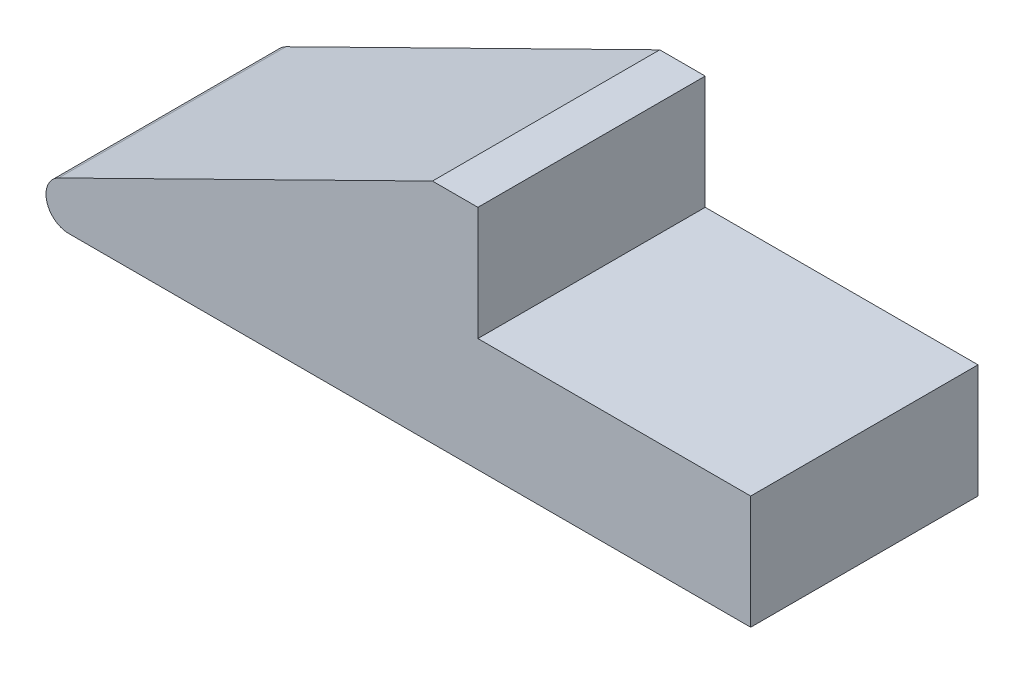
ISO-10303-21;
HEADER;
FILE_DESCRIPTION(('STEP AP214'),'2;1');
FILE_NAME('part.step','',(''),(''),'','','');
FILE_SCHEMA(('AUTOMOTIVE_DESIGN { 1 0 10303 214 1 1 1 1 }'));
ENDSEC;
DATA;
#1=APPLICATION_CONTEXT('core data for automotive mechanical design processes');
#2=APPLICATION_PROTOCOL_DEFINITION('international standard','automotive_design',2000,#1);
#3=PRODUCT_CONTEXT('',#1,'mechanical');
#4=PRODUCT('Part','Part','',(#3));
#5=PRODUCT_RELATED_PRODUCT_CATEGORY('part','',(#4));
#6=PRODUCT_DEFINITION_FORMATION('','',#4);
#7=PRODUCT_DEFINITION_CONTEXT('part definition',#1,'design');
#8=PRODUCT_DEFINITION('design','',#6,#7);
#9=PRODUCT_DEFINITION_SHAPE('','',#8);
#10=(LENGTH_UNIT() NAMED_UNIT(*) SI_UNIT(.MILLI.,.METRE.));
#11=(NAMED_UNIT(*) PLANE_ANGLE_UNIT() SI_UNIT($,.RADIAN.));
#12=(NAMED_UNIT(*) SI_UNIT($,.STERADIAN.) SOLID_ANGLE_UNIT());
#13=UNCERTAINTY_MEASURE_WITH_UNIT(LENGTH_MEASURE(1.E-05),#10,'distance_accuracy_value','');
#14=(GEOMETRIC_REPRESENTATION_CONTEXT(3) GLOBAL_UNCERTAINTY_ASSIGNED_CONTEXT((#13)) GLOBAL_UNIT_ASSIGNED_CONTEXT((#10,
#11,#12)) REPRESENTATION_CONTEXT('',''));
#15=CARTESIAN_POINT('',(0.,0.,0.));
#16=DIRECTION('',(0.,0.,1.));
#17=DIRECTION('',(1.,0.,0.));
#18=AXIS2_PLACEMENT_3D('',#15,#16,#17);
#19=CARTESIAN_POINT('',(18.,10.,5.));
#20=DIRECTION('',(0.,-1.,0.));
#21=DIRECTION('',(1.,0.,0.));
#22=AXIS2_PLACEMENT_3D('',#19,#20,#21);
#23=PLANE('',#22);
#24=DIRECTION('',(-1.,0.,0.));
#25=VECTOR('',#24,1.);
#26=CARTESIAN_POINT('',(18.,10.,-5.));
#27=LINE('',#26,#25);
#28=CARTESIAN_POINT('',(18.,10.,-5.));
#29=VERTEX_POINT('',#28);
#30=CARTESIAN_POINT('',(16.,10.,-5.));
#31=VERTEX_POINT('',#30);
#32=EDGE_CURVE('E105',#29,#31,#27,.T.);
#33=ORIENTED_EDGE('',*,*,#32,.T.);
#34=DIRECTION('',(0.,0.,-1.));
#35=VECTOR('',#34,1.);
#36=CARTESIAN_POINT('',(16.,10.,5.));
#37=LINE('',#36,#35);
#38=CARTESIAN_POINT('',(16.,10.,5.));
#39=VERTEX_POINT('',#38);
#40=EDGE_CURVE('E11',#39,#31,#37,.T.);
#41=ORIENTED_EDGE('',*,*,#40,.F.);
#42=DIRECTION('',(-1.,0.,0.));
#43=VECTOR('',#42,1.);
#44=CARTESIAN_POINT('',(18.,10.,5.));
#45=LINE('',#44,#43);
#46=CARTESIAN_POINT('',(18.,10.,5.));
#47=VERTEX_POINT('',#46);
#48=EDGE_CURVE('E125',#47,#39,#45,.T.);
#49=ORIENTED_EDGE('',*,*,#48,.F.);
#50=DIRECTION('',(0.,0.,-1.));
#51=VECTOR('',#50,1.);
#52=CARTESIAN_POINT('',(18.,10.,5.));
#53=LINE('',#52,#51);
#54=EDGE_CURVE('E50',#47,#29,#53,.T.);
#55=ORIENTED_EDGE('',*,*,#54,.T.);
#56=EDGE_LOOP('',(#33,#41,#49,#55));
#57=FACE_BOUND('',#56,.T.);
#58=ADVANCED_FACE('F36',(#57),#23,.F.);
#59=CARTESIAN_POINT('',(-0.442055563852849,1.89698766907174,5.));
#60=DIRECTION('',(-0.442055563852849,0.896987669071732,0.));
#61=DIRECTION('',(-0.896987669071732,-0.442055563852849,0.));
#62=AXIS2_PLACEMENT_3D('',#59,#60,#61);
#63=PLANE('',#62);
#64=DIRECTION('',(0.896987669071732,0.442055563852849,0.));
#65=VECTOR('',#64,1.);
#66=CARTESIAN_POINT('',(-0.442055563852849,1.89698766907174,-5.));
#67=LINE('',#66,#65);
#68=CARTESIAN_POINT('',(-0.44205556385285,1.89698766907174,-5.));
#69=VERTEX_POINT('',#68);
#70=EDGE_CURVE('E99',#69,#31,#67,.T.);
#71=ORIENTED_EDGE('',*,*,#70,.F.);
#72=DIRECTION('',(0.,0.,-1.));
#73=VECTOR('',#72,1.);
#74=CARTESIAN_POINT('',(-0.44205556385285,1.89698766907174,5.));
#75=LINE('',#74,#73);
#76=CARTESIAN_POINT('',(-0.44205556385285,1.89698766907174,5.));
#77=VERTEX_POINT('',#76);
#78=EDGE_CURVE('E43',#77,#69,#75,.T.);
#79=ORIENTED_EDGE('',*,*,#78,.F.);
#80=DIRECTION('',(0.896987669071732,0.442055563852849,0.));
#81=VECTOR('',#80,1.);
#82=CARTESIAN_POINT('',(-0.442055563852849,1.89698766907174,5.));
#83=LINE('',#82,#81);
#84=EDGE_CURVE('E102',#77,#39,#83,.T.);
#85=ORIENTED_EDGE('',*,*,#84,.T.);
#86=ORIENTED_EDGE('',*,*,#40,.T.);
#87=EDGE_LOOP('',(#71,#79,#85,#86));
#88=FACE_BOUND('',#87,.T.);
#89=ADVANCED_FACE('F97',(#88),#63,.T.);
#90=CARTESIAN_POINT('',(0.,1.00000000000001,5.));
#91=DIRECTION('',(0.,0.,-1.));
#92=DIRECTION('',(-1.,0.,0.));
#93=AXIS2_PLACEMENT_3D('',#90,#91,#92);
#94=CYLINDRICAL_SURFACE('',#93,1.);
#95=CARTESIAN_POINT('',(0.,1.00000000000001,-5.));
#96=DIRECTION('',(0.,0.,-1.));
#97=DIRECTION('',(-1.,0.,0.));
#98=AXIS2_PLACEMENT_3D('',#95,#96,#97);
#99=CIRCLE('',#98,1.);
#100=CARTESIAN_POINT('',(0.,0.,-5.));
#101=VERTEX_POINT('',#100);
#102=EDGE_CURVE('E112',#101,#69,#99,.T.);
#103=ORIENTED_EDGE('',*,*,#102,.F.);
#104=DIRECTION('',(0.,0.,-1.));
#105=VECTOR('',#104,1.);
#106=CARTESIAN_POINT('',(0.,0.,5.));
#107=LINE('',#106,#105);
#108=CARTESIAN_POINT('',(0.,0.,5.));
#109=VERTEX_POINT('',#108);
#110=EDGE_CURVE('E147',#109,#101,#107,.T.);
#111=ORIENTED_EDGE('',*,*,#110,.F.);
#112=CARTESIAN_POINT('',(0.,1.00000000000001,5.));
#113=DIRECTION('',(0.,0.,-1.));
#114=DIRECTION('',(-1.,0.,0.));
#115=AXIS2_PLACEMENT_3D('',#112,#113,#114);
#116=CIRCLE('',#115,1.);
#117=EDGE_CURVE('E128',#109,#77,#116,.T.);
#118=ORIENTED_EDGE('',*,*,#117,.T.);
#119=ORIENTED_EDGE('',*,*,#78,.T.);
#120=EDGE_LOOP('',(#103,#111,#118,#119));
#121=FACE_BOUND('',#120,.T.);
#122=ADVANCED_FACE('F149',(#121),#94,.T.);
#123=CARTESIAN_POINT('',(30.,0.,5.));
#124=DIRECTION('',(0.,-1.,0.));
#125=DIRECTION('',(1.,0.,0.));
#126=AXIS2_PLACEMENT_3D('',#123,#124,#125);
#127=PLANE('',#126);
#128=DIRECTION('',(-1.,0.,0.));
#129=VECTOR('',#128,1.);
#130=CARTESIAN_POINT('',(30.,0.,-5.));
#131=LINE('',#130,#129);
#132=CARTESIAN_POINT('',(30.,0.,-5.));
#133=VERTEX_POINT('',#132);
#134=EDGE_CURVE('E114',#133,#101,#131,.T.);
#135=ORIENTED_EDGE('',*,*,#134,.F.);
#136=DIRECTION('',(0.,0.,-1.));
#137=VECTOR('',#136,1.);
#138=CARTESIAN_POINT('',(30.,0.,5.));
#139=LINE('',#138,#137);
#140=CARTESIAN_POINT('',(30.,0.,5.));
#141=VERTEX_POINT('',#140);
#142=EDGE_CURVE('E145',#141,#133,#139,.T.);
#143=ORIENTED_EDGE('',*,*,#142,.F.);
#144=DIRECTION('',(-1.,0.,0.));
#145=VECTOR('',#144,1.);
#146=CARTESIAN_POINT('',(30.,0.,5.));
#147=LINE('',#146,#145);
#148=EDGE_CURVE('E131',#141,#109,#147,.T.);
#149=ORIENTED_EDGE('',*,*,#148,.T.);
#150=ORIENTED_EDGE('',*,*,#110,.T.);
#151=EDGE_LOOP('',(#135,#143,#149,#150));
#152=FACE_BOUND('',#151,.T.);
#153=ADVANCED_FACE('F162',(#152),#127,.T.);
#154=CARTESIAN_POINT('',(30.,0.,5.));
#155=DIRECTION('',(-1.,0.,0.));
#156=DIRECTION('',(0.,0.,1.));
#157=AXIS2_PLACEMENT_3D('',#154,#155,#156);
#158=PLANE('',#157);
#159=DIRECTION('',(0.,1.,0.));
#160=VECTOR('',#159,1.);
#161=CARTESIAN_POINT('',(30.,0.,-5.));
#162=LINE('',#161,#160);
#163=CARTESIAN_POINT('',(30.,5.,-5.));
#164=VERTEX_POINT('',#163);
#165=EDGE_CURVE('E118',#133,#164,#162,.T.);
#166=ORIENTED_EDGE('',*,*,#165,.T.);
#167=DIRECTION('',(0.,0.,-1.));
#168=VECTOR('',#167,1.);
#169=CARTESIAN_POINT('',(30.,5.,5.));
#170=LINE('',#169,#168);
#171=CARTESIAN_POINT('',(30.,5.,5.));
#172=VERTEX_POINT('',#171);
#173=EDGE_CURVE('E142',#172,#164,#170,.T.);
#174=ORIENTED_EDGE('',*,*,#173,.F.);
#175=DIRECTION('',(0.,1.,0.));
#176=VECTOR('',#175,1.);
#177=CARTESIAN_POINT('',(30.,0.,5.));
#178=LINE('',#177,#176);
#179=EDGE_CURVE('E134',#141,#172,#178,.T.);
#180=ORIENTED_EDGE('',*,*,#179,.F.);
#181=ORIENTED_EDGE('',*,*,#142,.T.);
#182=EDGE_LOOP('',(#166,#174,#180,#181));
#183=FACE_BOUND('',#182,.T.);
#184=ADVANCED_FACE('F164',(#183),#158,.F.);
#185=CARTESIAN_POINT('',(30.,5.,5.));
#186=DIRECTION('',(0.,-1.,0.));
#187=DIRECTION('',(1.,0.,0.));
#188=AXIS2_PLACEMENT_3D('',#185,#186,#187);
#189=PLANE('',#188);
#190=DIRECTION('',(-1.,0.,0.));
#191=VECTOR('',#190,1.);
#192=CARTESIAN_POINT('',(30.,5.,-5.));
#193=LINE('',#192,#191);
#194=CARTESIAN_POINT('',(18.,5.,-5.));
#195=VERTEX_POINT('',#194);
#196=EDGE_CURVE('E120',#164,#195,#193,.T.);
#197=ORIENTED_EDGE('',*,*,#196,.T.);
#198=DIRECTION('',(0.,0.,-1.));
#199=VECTOR('',#198,1.);
#200=CARTESIAN_POINT('',(18.,5.,5.));
#201=LINE('',#200,#199);
#202=CARTESIAN_POINT('',(18.,5.,5.));
#203=VERTEX_POINT('',#202);
#204=EDGE_CURVE('E140',#203,#195,#201,.T.);
#205=ORIENTED_EDGE('',*,*,#204,.F.);
#206=DIRECTION('',(-1.,0.,0.));
#207=VECTOR('',#206,1.);
#208=CARTESIAN_POINT('',(30.,5.,5.));
#209=LINE('',#208,#207);
#210=EDGE_CURVE('E58',#172,#203,#209,.T.);
#211=ORIENTED_EDGE('',*,*,#210,.F.);
#212=ORIENTED_EDGE('',*,*,#173,.T.);
#213=EDGE_LOOP('',(#197,#205,#211,#212));
#214=FACE_BOUND('',#213,.T.);
#215=ADVANCED_FACE('F156',(#214),#189,.F.);
#216=CARTESIAN_POINT('',(18.,10.,5.));
#217=DIRECTION('',(1.,0.,0.));
#218=DIRECTION('',(0.,1.,0.));
#219=AXIS2_PLACEMENT_3D('',#216,#217,#218);
#220=PLANE('',#219);
#221=DIRECTION('',(0.,-1.,0.));
#222=VECTOR('',#221,1.);
#223=CARTESIAN_POINT('',(18.,10.,-5.));
#224=LINE('',#223,#222);
#225=EDGE_CURVE('E123',#29,#195,#224,.T.);
#226=ORIENTED_EDGE('',*,*,#225,.F.);
#227=ORIENTED_EDGE('',*,*,#54,.F.);
#228=DIRECTION('',(0.,-1.,0.));
#229=VECTOR('',#228,1.);
#230=CARTESIAN_POINT('',(18.,10.,5.));
#231=LINE('',#230,#229);
#232=EDGE_CURVE('E137',#47,#203,#231,.T.);
#233=ORIENTED_EDGE('',*,*,#232,.T.);
#234=ORIENTED_EDGE('',*,*,#204,.T.);
#235=EDGE_LOOP('',(#226,#227,#233,#234));
#236=FACE_BOUND('',#235,.T.);
#237=ADVANCED_FACE('F153',(#236),#220,.T.);
#238=CARTESIAN_POINT('',(0.,1.00000000000001,5.));
#239=DIRECTION('',(0.,0.,-1.));
#240=DIRECTION('',(-1.,0.,0.));
#241=AXIS2_PLACEMENT_3D('',#238,#239,#240);
#242=PLANE('',#241);
#243=ORIENTED_EDGE('',*,*,#48,.T.);
#244=ORIENTED_EDGE('',*,*,#84,.F.);
#245=ORIENTED_EDGE('',*,*,#117,.F.);
#246=ORIENTED_EDGE('',*,*,#148,.F.);
#247=ORIENTED_EDGE('',*,*,#179,.T.);
#248=ORIENTED_EDGE('',*,*,#210,.T.);
#249=ORIENTED_EDGE('',*,*,#232,.F.);
#250=EDGE_LOOP('',(#243,#244,#245,#246,#247,#248,#249));
#251=FACE_BOUND('',#250,.T.);
#252=ADVANCED_FACE('F151',(#251),#242,.F.);
#253=CARTESIAN_POINT('',(0.,1.00000000000001,-5.));
#254=DIRECTION('',(0.,0.,-1.));
#255=DIRECTION('',(-1.,0.,0.));
#256=AXIS2_PLACEMENT_3D('',#253,#254,#255);
#257=PLANE('',#256);
#258=ORIENTED_EDGE('',*,*,#32,.F.);
#259=ORIENTED_EDGE('',*,*,#225,.T.);
#260=ORIENTED_EDGE('',*,*,#196,.F.);
#261=ORIENTED_EDGE('',*,*,#165,.F.);
#262=ORIENTED_EDGE('',*,*,#134,.T.);
#263=ORIENTED_EDGE('',*,*,#102,.T.);
#264=ORIENTED_EDGE('',*,*,#70,.T.);
#265=EDGE_LOOP('',(#258,#259,#260,#261,#262,#263,#264));
#266=FACE_BOUND('',#265,.T.);
#267=ADVANCED_FACE('F109',(#266),#257,.T.);
#268=CLOSED_SHELL('',(#58,#89,#122,#153,#184,#215,#237,#252,#267));
#269=MANIFOLD_SOLID_BREP('B2',#268);
#270=ADVANCED_BREP_SHAPE_REPRESENTATION('',(#18,#269),#14);
#271=SHAPE_DEFINITION_REPRESENTATION(#9,#270);
ENDSEC;
END-ISO-10303-21;
